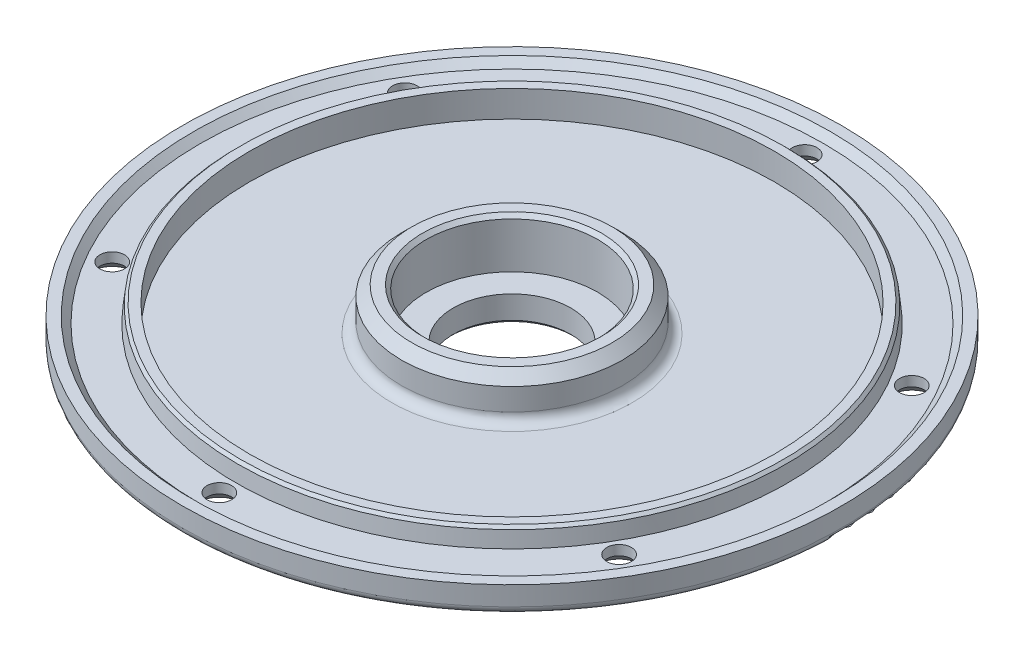
ISO-10303-21;
HEADER;
FILE_DESCRIPTION(('STEP AP214'),'2;1');
FILE_NAME('part.step','',(''),(''),'','','');
FILE_SCHEMA(('AUTOMOTIVE_DESIGN { 1 0 10303 214 1 1 1 1 }'));
ENDSEC;
DATA;
#1=APPLICATION_CONTEXT('core data for automotive mechanical design processes');
#2=APPLICATION_PROTOCOL_DEFINITION('international standard','automotive_design',2000,#1);
#3=PRODUCT_CONTEXT('',#1,'mechanical');
#4=PRODUCT('Part','Part','',(#3));
#5=PRODUCT_RELATED_PRODUCT_CATEGORY('part','',(#4));
#6=PRODUCT_DEFINITION_FORMATION('','',#4);
#7=PRODUCT_DEFINITION_CONTEXT('part definition',#1,'design');
#8=PRODUCT_DEFINITION('design','',#6,#7);
#9=PRODUCT_DEFINITION_SHAPE('','',#8);
#10=(LENGTH_UNIT() NAMED_UNIT(*) SI_UNIT(.MILLI.,.METRE.));
#11=(NAMED_UNIT(*) PLANE_ANGLE_UNIT() SI_UNIT($,.RADIAN.));
#12=(NAMED_UNIT(*) SI_UNIT($,.STERADIAN.) SOLID_ANGLE_UNIT());
#13=UNCERTAINTY_MEASURE_WITH_UNIT(LENGTH_MEASURE(1.E-05),#10,'distance_accuracy_value','');
#14=(GEOMETRIC_REPRESENTATION_CONTEXT(3) GLOBAL_UNCERTAINTY_ASSIGNED_CONTEXT((#13)) GLOBAL_UNIT_ASSIGNED_CONTEXT((#10,
#11,#12)) REPRESENTATION_CONTEXT('',''));
#15=CARTESIAN_POINT('',(0.,0.,0.));
#16=DIRECTION('',(0.,0.,1.));
#17=DIRECTION('',(1.,0.,0.));
#18=AXIS2_PLACEMENT_3D('',#15,#16,#17);
#19=CARTESIAN_POINT('',(0.,0.,0.));
#20=DIRECTION('',(0.,-1.,0.));
#21=DIRECTION('',(0.,0.,-1.));
#22=AXIS2_PLACEMENT_3D('',#19,#20,#21);
#23=CYLINDRICAL_SURFACE('',#22,11.95);
#24=CARTESIAN_POINT('',(0.,56.6,0.));
#25=DIRECTION('',(0.,-1.,0.));
#26=DIRECTION('',(0.,0.,-1.));
#27=AXIS2_PLACEMENT_3D('',#24,#25,#26);
#28=CIRCLE('',#27,11.95);
#29=CARTESIAN_POINT('',(0.,56.6,-11.95));
#30=VERTEX_POINT('',#29);
#31=EDGE_CURVE('E84',#30,#30,#28,.T.);
#32=ORIENTED_EDGE('',*,*,#31,.F.);
#33=EDGE_LOOP('',(#32));
#34=FACE_BOUND('',#33,.T.);
#35=CARTESIAN_POINT('',(0.,51.95,0.));
#36=DIRECTION('',(0.,-1.,0.));
#37=DIRECTION('',(0.,0.,-1.));
#38=AXIS2_PLACEMENT_3D('',#35,#36,#37);
#39=CIRCLE('',#38,11.95);
#40=CARTESIAN_POINT('',(0.,51.95,-11.95));
#41=VERTEX_POINT('',#40);
#42=EDGE_CURVE('E147',#41,#41,#39,.T.);
#43=ORIENTED_EDGE('',*,*,#42,.T.);
#44=EDGE_LOOP('',(#43));
#45=FACE_BOUND('',#44,.T.);
#46=ADVANCED_FACE('F39',(#34,#45),#23,.F.);
#47=CARTESIAN_POINT('',(-11.95,56.6,0.));
#48=DIRECTION('',(0.,-1.,0.));
#49=DIRECTION('',(0.,0.,-1.));
#50=AXIS2_PLACEMENT_3D('',#47,#48,#49);
#51=PLANE('',#50);
#52=CARTESIAN_POINT('',(0.,56.6,0.));
#53=DIRECTION('',(0.,-1.,0.));
#54=DIRECTION('',(0.,0.,-1.));
#55=AXIS2_PLACEMENT_3D('',#52,#53,#54);
#56=CIRCLE('',#55,17.45);
#57=CARTESIAN_POINT('',(0.,56.6,-17.45));
#58=VERTEX_POINT('',#57);
#59=EDGE_CURVE('E87',#58,#58,#56,.T.);
#60=ORIENTED_EDGE('',*,*,#59,.F.);
#61=EDGE_LOOP('',(#60));
#62=FACE_BOUND('',#61,.T.);
#63=ORIENTED_EDGE('',*,*,#31,.T.);
#64=EDGE_LOOP('',(#63));
#65=FACE_BOUND('',#64,.T.);
#66=ADVANCED_FACE('F192',(#62,#65),#51,.F.);
#67=CARTESIAN_POINT('',(0.,0.,0.));
#68=DIRECTION('',(0.,-1.,0.));
#69=DIRECTION('',(0.,0.,-1.));
#70=AXIS2_PLACEMENT_3D('',#67,#68,#69);
#71=CYLINDRICAL_SURFACE('',#70,17.45);
#72=CARTESIAN_POINT('',(0.,65.9,0.));
#73=DIRECTION('',(0.,-1.,0.));
#74=DIRECTION('',(0.,0.,-1.));
#75=AXIS2_PLACEMENT_3D('',#72,#73,#74);
#76=CIRCLE('',#75,17.45);
#77=CARTESIAN_POINT('',(0.,65.9,-17.45));
#78=VERTEX_POINT('',#77);
#79=EDGE_CURVE('E90',#78,#78,#76,.T.);
#80=ORIENTED_EDGE('',*,*,#79,.F.);
#81=EDGE_LOOP('',(#80));
#82=FACE_BOUND('',#81,.T.);
#83=ORIENTED_EDGE('',*,*,#59,.T.);
#84=EDGE_LOOP('',(#83));
#85=FACE_BOUND('',#84,.T.);
#86=ADVANCED_FACE('F198',(#82,#85),#71,.F.);
#87=CARTESIAN_POINT('',(0.,65.9,0.));
#88=DIRECTION('',(0.,1.,0.));
#89=DIRECTION('',(0.,0.,1.));
#90=AXIS2_PLACEMENT_3D('',#87,#88,#89);
#91=CONICAL_SURFACE('',#90,17.45,0.785398163397448);
#92=CARTESIAN_POINT('',(0.,66.65,0.));
#93=DIRECTION('',(0.,-1.,0.));
#94=DIRECTION('',(0.,0.,-1.));
#95=AXIS2_PLACEMENT_3D('',#92,#93,#94);
#96=CIRCLE('',#95,18.2);
#97=CARTESIAN_POINT('',(0.,66.65,-18.2));
#98=VERTEX_POINT('',#97);
#99=EDGE_CURVE('E93',#98,#98,#96,.T.);
#100=ORIENTED_EDGE('',*,*,#99,.F.);
#101=EDGE_LOOP('',(#100));
#102=FACE_BOUND('',#101,.T.);
#103=ORIENTED_EDGE('',*,*,#79,.T.);
#104=EDGE_LOOP('',(#103));
#105=FACE_BOUND('',#104,.T.);
#106=ADVANCED_FACE('F484',(#102,#105),#91,.F.);
#107=CARTESIAN_POINT('',(-18.2,66.65,0.));
#108=DIRECTION('',(0.,-1.,0.));
#109=DIRECTION('',(0.,0.,-1.));
#110=AXIS2_PLACEMENT_3D('',#107,#108,#109);
#111=PLANE('',#110);
#112=CARTESIAN_POINT('',(0.,66.65,0.));
#113=DIRECTION('',(0.,-1.,0.));
#114=DIRECTION('',(0.,0.,-1.));
#115=AXIS2_PLACEMENT_3D('',#112,#113,#114);
#116=CIRCLE('',#115,20.4);
#117=CARTESIAN_POINT('',(0.,66.65,-20.4));
#118=VERTEX_POINT('',#117);
#119=EDGE_CURVE('E96',#118,#118,#116,.T.);
#120=ORIENTED_EDGE('',*,*,#119,.F.);
#121=EDGE_LOOP('',(#120));
#122=FACE_BOUND('',#121,.T.);
#123=ORIENTED_EDGE('',*,*,#99,.T.);
#124=EDGE_LOOP('',(#123));
#125=FACE_BOUND('',#124,.T.);
#126=ADVANCED_FACE('F475',(#122,#125),#111,.F.);
#127=CARTESIAN_POINT('',(0.,66.65,0.));
#128=DIRECTION('',(0.,-1.,0.));
#129=DIRECTION('',(0.,0.,-1.));
#130=AXIS2_PLACEMENT_3D('',#127,#128,#129);
#131=CONICAL_SURFACE('',#130,20.4,0.785398163397447);
#132=CARTESIAN_POINT('',(0.,64.6,0.));
#133=DIRECTION('',(0.,-1.,0.));
#134=DIRECTION('',(0.,0.,-1.));
#135=AXIS2_PLACEMENT_3D('',#132,#133,#134);
#136=CIRCLE('',#135,22.45);
#137=CARTESIAN_POINT('',(0.,64.6,-22.45));
#138=VERTEX_POINT('',#137);
#139=EDGE_CURVE('E99',#138,#138,#136,.T.);
#140=ORIENTED_EDGE('',*,*,#139,.F.);
#141=EDGE_LOOP('',(#140));
#142=FACE_BOUND('',#141,.T.);
#143=ORIENTED_EDGE('',*,*,#119,.T.);
#144=EDGE_LOOP('',(#143));
#145=FACE_BOUND('',#144,.T.);
#146=ADVANCED_FACE('F466',(#142,#145),#131,.T.);
#147=CARTESIAN_POINT('',(0.,0.,0.));
#148=DIRECTION('',(0.,-1.,0.));
#149=DIRECTION('',(0.,0.,-1.));
#150=AXIS2_PLACEMENT_3D('',#147,#148,#149);
#151=CYLINDRICAL_SURFACE('',#150,22.45);
#152=CARTESIAN_POINT('',(0.,60.1,0.));
#153=DIRECTION('',(0.,-1.,0.));
#154=DIRECTION('',(0.,0.,-1.));
#155=AXIS2_PLACEMENT_3D('',#152,#153,#154);
#156=CIRCLE('',#155,22.45);
#157=CARTESIAN_POINT('',(0.,60.1,-22.45));
#158=VERTEX_POINT('',#157);
#159=EDGE_CURVE('E102',#158,#158,#156,.T.);
#160=ORIENTED_EDGE('',*,*,#159,.F.);
#161=EDGE_LOOP('',(#160));
#162=FACE_BOUND('',#161,.T.);
#163=ORIENTED_EDGE('',*,*,#139,.T.);
#164=EDGE_LOOP('',(#163));
#165=FACE_BOUND('',#164,.T.);
#166=ADVANCED_FACE('F457',(#162,#165),#151,.T.);
#167=CARTESIAN_POINT('',(0.,60.1,0.));
#168=DIRECTION('',(0.,-1.,0.));
#169=DIRECTION('',(0.,0.,-1.));
#170=AXIS2_PLACEMENT_3D('',#167,#168,#169);
#171=TOROIDAL_SURFACE('',#170,24.45,2.);
#172=CARTESIAN_POINT('',(0.,58.1,0.));
#173=DIRECTION('',(0.,-1.,0.));
#174=DIRECTION('',(0.,0.,-1.));
#175=AXIS2_PLACEMENT_3D('',#172,#173,#174);
#176=CIRCLE('',#175,24.45);
#177=CARTESIAN_POINT('',(0.,58.1,-24.45));
#178=VERTEX_POINT('',#177);
#179=EDGE_CURVE('E105',#178,#178,#176,.T.);
#180=ORIENTED_EDGE('',*,*,#179,.F.);
#181=EDGE_LOOP('',(#180));
#182=FACE_BOUND('',#181,.T.);
#183=ORIENTED_EDGE('',*,*,#159,.T.);
#184=EDGE_LOOP('',(#183));
#185=FACE_BOUND('',#184,.T.);
#186=ADVANCED_FACE('F448',(#182,#185),#171,.F.);
#187=CARTESIAN_POINT('',(-53.35,58.1,0.));
#188=DIRECTION('',(0.,-1.,0.));
#189=DIRECTION('',(0.,0.,-1.));
#190=AXIS2_PLACEMENT_3D('',#187,#188,#189);
#191=PLANE('',#190);
#192=CARTESIAN_POINT('',(0.,58.1,0.));
#193=DIRECTION('',(0.,-1.,0.));
#194=DIRECTION('',(0.,0.,-1.));
#195=AXIS2_PLACEMENT_3D('',#192,#193,#194);
#196=CIRCLE('',#195,53.35);
#197=CARTESIAN_POINT('',(0.,58.1,-53.35));
#198=VERTEX_POINT('',#197);
#199=EDGE_CURVE('E108',#198,#198,#196,.T.);
#200=ORIENTED_EDGE('',*,*,#199,.F.);
#201=EDGE_LOOP('',(#200));
#202=FACE_BOUND('',#201,.T.);
#203=ORIENTED_EDGE('',*,*,#179,.T.);
#204=EDGE_LOOP('',(#203));
#205=FACE_BOUND('',#204,.T.);
#206=ADVANCED_FACE('F439',(#202,#205),#191,.F.);
#207=CARTESIAN_POINT('',(0.,0.,0.));
#208=DIRECTION('',(0.,-1.,0.));
#209=DIRECTION('',(0.,0.,-1.));
#210=AXIS2_PLACEMENT_3D('',#207,#208,#209);
#211=CYLINDRICAL_SURFACE('',#210,53.35);
#212=CARTESIAN_POINT('',(0.,63.5,0.));
#213=DIRECTION('',(0.,-1.,0.));
#214=DIRECTION('',(0.,0.,-1.));
#215=AXIS2_PLACEMENT_3D('',#212,#213,#214);
#216=CIRCLE('',#215,53.35);
#217=CARTESIAN_POINT('',(0.,63.5,-53.35));
#218=VERTEX_POINT('',#217);
#219=EDGE_CURVE('E111',#218,#218,#216,.T.);
#220=ORIENTED_EDGE('',*,*,#219,.F.);
#221=EDGE_LOOP('',(#220));
#222=FACE_BOUND('',#221,.T.);
#223=ORIENTED_EDGE('',*,*,#199,.T.);
#224=EDGE_LOOP('',(#223));
#225=FACE_BOUND('',#224,.T.);
#226=ADVANCED_FACE('F430',(#222,#225),#211,.F.);
#227=CARTESIAN_POINT('',(-55.2,63.5,0.));
#228=DIRECTION('',(0.,-1.,0.));
#229=DIRECTION('',(0.,0.,-1.));
#230=AXIS2_PLACEMENT_3D('',#227,#228,#229);
#231=PLANE('',#230);
#232=CARTESIAN_POINT('',(0.,63.5,0.));
#233=DIRECTION('',(0.,-1.,0.));
#234=DIRECTION('',(0.,0.,-1.));
#235=AXIS2_PLACEMENT_3D('',#232,#233,#234);
#236=CIRCLE('',#235,55.2);
#237=CARTESIAN_POINT('',(0.,63.5,-55.2));
#238=VERTEX_POINT('',#237);
#239=EDGE_CURVE('E114',#238,#238,#236,.T.);
#240=ORIENTED_EDGE('',*,*,#239,.F.);
#241=EDGE_LOOP('',(#240));
#242=FACE_BOUND('',#241,.T.);
#243=ORIENTED_EDGE('',*,*,#219,.T.);
#244=EDGE_LOOP('',(#243));
#245=FACE_BOUND('',#244,.T.);
#246=ADVANCED_FACE('F421',(#242,#245),#231,.F.);
#247=CARTESIAN_POINT('',(0.,63.5,0.));
#248=DIRECTION('',(0.,-1.,0.));
#249=DIRECTION('',(0.,0.,-1.));
#250=AXIS2_PLACEMENT_3D('',#247,#248,#249);
#251=CONICAL_SURFACE('',#250,55.2,0.785398163397448);
#252=CARTESIAN_POINT('',(0.,62.95,0.));
#253=DIRECTION('',(0.,-1.,0.));
#254=DIRECTION('',(0.,0.,-1.));
#255=AXIS2_PLACEMENT_3D('',#252,#253,#254);
#256=CIRCLE('',#255,55.75);
#257=CARTESIAN_POINT('',(0.,62.95,-55.75));
#258=VERTEX_POINT('',#257);
#259=EDGE_CURVE('E117',#258,#258,#256,.T.);
#260=ORIENTED_EDGE('',*,*,#259,.F.);
#261=EDGE_LOOP('',(#260));
#262=FACE_BOUND('',#261,.T.);
#263=ORIENTED_EDGE('',*,*,#239,.T.);
#264=EDGE_LOOP('',(#263));
#265=FACE_BOUND('',#264,.T.);
#266=ADVANCED_FACE('F412',(#262,#265),#251,.T.);
#267=CARTESIAN_POINT('',(0.,62.95,0.));
#268=DIRECTION('',(0.,-1.,0.));
#269=DIRECTION('',(0.,0.,-1.));
#270=AXIS2_PLACEMENT_3D('',#267,#268,#269);
#271=CONICAL_SURFACE('',#270,55.75,0.110657221173897);
#272=CARTESIAN_POINT('',(0.,59.8,0.));
#273=DIRECTION('',(0.,-1.,0.));
#274=DIRECTION('',(0.,0.,-1.));
#275=AXIS2_PLACEMENT_3D('',#272,#273,#274);
#276=CIRCLE('',#275,56.1);
#277=CARTESIAN_POINT('',(0.,59.8,-56.1));
#278=VERTEX_POINT('',#277);
#279=EDGE_CURVE('E120',#278,#278,#276,.T.);
#280=ORIENTED_EDGE('',*,*,#279,.F.);
#281=EDGE_LOOP('',(#280));
#282=FACE_BOUND('',#281,.T.);
#283=ORIENTED_EDGE('',*,*,#259,.T.);
#284=EDGE_LOOP('',(#283));
#285=FACE_BOUND('',#284,.T.);
#286=ADVANCED_FACE('F252',(#282,#285),#271,.T.);
#287=CARTESIAN_POINT('',(-63.4,59.8,0.));
#288=DIRECTION('',(0.,-1.,0.));
#289=DIRECTION('',(0.,0.,-1.));
#290=AXIS2_PLACEMENT_3D('',#287,#288,#289);
#291=PLANE('',#290);
#292=CARTESIAN_POINT('',(51.5285115251737,59.8,29.7500000000006));
#293=DIRECTION('',(0.,-1.,0.));
#294=DIRECTION('',(0.,0.,-1.));
#295=AXIS2_PLACEMENT_3D('',#292,#293,#294);
#296=CIRCLE('',#295,2.5);
#297=CARTESIAN_POINT('',(51.5285115251737,59.8,27.2500000000006));
#298=VERTEX_POINT('',#297);
#299=EDGE_CURVE('E153',#298,#298,#296,.T.);
#300=ORIENTED_EDGE('',*,*,#299,.T.);
#301=EDGE_LOOP('',(#300));
#302=FACE_BOUND('',#301,.T.);
#303=CARTESIAN_POINT('',(51.5285115251744,59.8,-29.7499999999995));
#304=DIRECTION('',(0.,-1.,0.));
#305=DIRECTION('',(0.,0.,-1.));
#306=AXIS2_PLACEMENT_3D('',#303,#304,#305);
#307=CIRCLE('',#306,2.5);
#308=CARTESIAN_POINT('',(51.5285115251744,59.8,-32.2499999999995));
#309=VERTEX_POINT('',#308);
#310=EDGE_CURVE('E156',#309,#309,#307,.T.);
#311=ORIENTED_EDGE('',*,*,#310,.T.);
#312=EDGE_LOOP('',(#311));
#313=FACE_BOUND('',#312,.T.);
#314=CARTESIAN_POINT('',(0.,59.8,-59.5));
#315=DIRECTION('',(0.,-1.,0.));
#316=DIRECTION('',(0.,0.,-1.));
#317=AXIS2_PLACEMENT_3D('',#314,#315,#316);
#318=CIRCLE('',#317,2.5);
#319=CARTESIAN_POINT('',(0.,59.8,-62.));
#320=VERTEX_POINT('',#319);
#321=EDGE_CURVE('E159',#320,#320,#318,.T.);
#322=ORIENTED_EDGE('',*,*,#321,.T.);
#323=EDGE_LOOP('',(#322));
#324=FACE_BOUND('',#323,.T.);
#325=CARTESIAN_POINT('',(-51.528511525174,59.8,-29.7500000000002));
#326=DIRECTION('',(0.,-1.,0.));
#327=DIRECTION('',(0.,0.,-1.));
#328=AXIS2_PLACEMENT_3D('',#325,#326,#327);
#329=CIRCLE('',#328,2.5);
#330=CARTESIAN_POINT('',(-51.528511525174,59.8,-32.2500000000002));
#331=VERTEX_POINT('',#330);
#332=EDGE_CURVE('E162',#331,#331,#329,.T.);
#333=ORIENTED_EDGE('',*,*,#332,.T.);
#334=EDGE_LOOP('',(#333));
#335=FACE_BOUND('',#334,.T.);
#336=CARTESIAN_POINT('',(-51.5285115251742,59.8,29.7499999999999));
#337=DIRECTION('',(0.,-1.,0.));
#338=DIRECTION('',(0.,0.,-1.));
#339=AXIS2_PLACEMENT_3D('',#336,#337,#338);
#340=CIRCLE('',#339,2.5);
#341=CARTESIAN_POINT('',(-51.5285115251742,59.8,27.2499999999999));
#342=VERTEX_POINT('',#341);
#343=EDGE_CURVE('E165',#342,#342,#340,.T.);
#344=ORIENTED_EDGE('',*,*,#343,.T.);
#345=EDGE_LOOP('',(#344));
#346=FACE_BOUND('',#345,.T.);
#347=CARTESIAN_POINT('',(0.,59.8,59.5));
#348=DIRECTION('',(0.,-1.,0.));
#349=DIRECTION('',(0.,0.,-1.));
#350=AXIS2_PLACEMENT_3D('',#347,#348,#349);
#351=CIRCLE('',#350,2.5);
#352=CARTESIAN_POINT('',(0.,59.8,57.));
#353=VERTEX_POINT('',#352);
#354=EDGE_CURVE('E150',#353,#353,#351,.T.);
#355=ORIENTED_EDGE('',*,*,#354,.T.);
#356=EDGE_LOOP('',(#355));
#357=FACE_BOUND('',#356,.T.);
#358=CARTESIAN_POINT('',(0.,59.8,0.));
#359=DIRECTION('',(0.,-1.,0.));
#360=DIRECTION('',(0.,0.,-1.));
#361=AXIS2_PLACEMENT_3D('',#358,#359,#360);
#362=CIRCLE('',#361,63.4);
#363=CARTESIAN_POINT('',(0.,59.8,-63.4));
#364=VERTEX_POINT('',#363);
#365=EDGE_CURVE('E123',#364,#364,#362,.T.);
#366=ORIENTED_EDGE('',*,*,#365,.F.);
#367=EDGE_LOOP('',(#366));
#368=FACE_BOUND('',#367,.T.);
#369=ORIENTED_EDGE('',*,*,#279,.T.);
#370=EDGE_LOOP('',(#369));
#371=FACE_BOUND('',#370,.T.);
#372=ADVANCED_FACE('F169',(#302,#313,#324,#335,#346,#357,#368,#371),#291,.F.);
#373=CARTESIAN_POINT('',(0.,59.8,0.));
#374=DIRECTION('',(0.,1.,0.));
#375=DIRECTION('',(0.,0.,1.));
#376=AXIS2_PLACEMENT_3D('',#373,#374,#375);
#377=CONICAL_SURFACE('',#376,63.4,0.785398163397448);
#378=CARTESIAN_POINT('',(0.,61.2,0.));
#379=DIRECTION('',(0.,-1.,0.));
#380=DIRECTION('',(0.,0.,-1.));
#381=AXIS2_PLACEMENT_3D('',#378,#379,#380);
#382=CIRCLE('',#381,64.8);
#383=CARTESIAN_POINT('',(0.,61.2,-64.8));
#384=VERTEX_POINT('',#383);
#385=EDGE_CURVE('E126',#384,#384,#382,.T.);
#386=ORIENTED_EDGE('',*,*,#385,.F.);
#387=EDGE_LOOP('',(#386));
#388=FACE_BOUND('',#387,.T.);
#389=ORIENTED_EDGE('',*,*,#365,.T.);
#390=EDGE_LOOP('',(#389));
#391=FACE_BOUND('',#390,.T.);
#392=ADVANCED_FACE('F251',(#388,#391),#377,.F.);
#393=CARTESIAN_POINT('',(-67.,61.2,0.));
#394=DIRECTION('',(0.,-1.,0.));
#395=DIRECTION('',(0.,0.,-1.));
#396=AXIS2_PLACEMENT_3D('',#393,#394,#395);
#397=PLANE('',#396);
#398=CARTESIAN_POINT('',(0.,61.2,0.));
#399=DIRECTION('',(0.,-1.,0.));
#400=DIRECTION('',(0.,0.,-1.));
#401=AXIS2_PLACEMENT_3D('',#398,#399,#400);
#402=CIRCLE('',#401,67.);
#403=CARTESIAN_POINT('',(0.,61.2,-67.));
#404=VERTEX_POINT('',#403);
#405=EDGE_CURVE('E129',#404,#404,#402,.T.);
#406=ORIENTED_EDGE('',*,*,#405,.F.);
#407=EDGE_LOOP('',(#406));
#408=FACE_BOUND('',#407,.T.);
#409=ORIENTED_EDGE('',*,*,#385,.T.);
#410=EDGE_LOOP('',(#409));
#411=FACE_BOUND('',#410,.T.);
#412=ADVANCED_FACE('F382',(#408,#411),#397,.F.);
#413=CARTESIAN_POINT('',(0.,0.,0.));
#414=DIRECTION('',(0.,-1.,0.));
#415=DIRECTION('',(0.,0.,-1.));
#416=AXIS2_PLACEMENT_3D('',#413,#414,#415);
#417=CYLINDRICAL_SURFACE('',#416,67.);
#418=CARTESIAN_POINT('',(0.,57.3,0.));
#419=DIRECTION('',(0.,-1.,0.));
#420=DIRECTION('',(0.,0.,-1.));
#421=AXIS2_PLACEMENT_3D('',#418,#419,#420);
#422=CIRCLE('',#421,67.);
#423=CARTESIAN_POINT('',(0.,57.3,-67.));
#424=VERTEX_POINT('',#423);
#425=EDGE_CURVE('E132',#424,#424,#422,.T.);
#426=ORIENTED_EDGE('',*,*,#425,.F.);
#427=EDGE_LOOP('',(#426));
#428=FACE_BOUND('',#427,.T.);
#429=ORIENTED_EDGE('',*,*,#405,.T.);
#430=EDGE_LOOP('',(#429));
#431=FACE_BOUND('',#430,.T.);
#432=ADVANCED_FACE('F373',(#428,#431),#417,.T.);
#433=CARTESIAN_POINT('',(0.,57.3,0.));
#434=DIRECTION('',(0.,-1.,0.));
#435=DIRECTION('',(0.,0.,-1.));
#436=AXIS2_PLACEMENT_3D('',#433,#434,#435);
#437=TOROIDAL_SURFACE('',#436,65.5,1.5);
#438=CARTESIAN_POINT('',(0.,55.8,0.));
#439=DIRECTION('',(0.,-1.,0.));
#440=DIRECTION('',(0.,0.,-1.));
#441=AXIS2_PLACEMENT_3D('',#438,#439,#440);
#442=CIRCLE('',#441,65.5);
#443=CARTESIAN_POINT('',(0.,55.8,-65.5));
#444=VERTEX_POINT('',#443);
#445=EDGE_CURVE('E135',#444,#444,#442,.T.);
#446=ORIENTED_EDGE('',*,*,#445,.F.);
#447=EDGE_LOOP('',(#446));
#448=FACE_BOUND('',#447,.T.);
#449=ORIENTED_EDGE('',*,*,#425,.T.);
#450=EDGE_LOOP('',(#449));
#451=FACE_BOUND('',#450,.T.);
#452=ADVANCED_FACE('F365',(#448,#451),#437,.T.);
#453=CARTESIAN_POINT('',(-21.9,55.8,0.));
#454=DIRECTION('',(0.,1.,0.));
#455=DIRECTION('',(0.,0.,1.));
#456=AXIS2_PLACEMENT_3D('',#453,#454,#455);
#457=PLANE('',#456);
#458=CARTESIAN_POINT('',(51.5285115251737,55.8,29.7500000000006));
#459=DIRECTION('',(0.,1.,0.));
#460=DIRECTION('',(0.,0.,1.));
#461=AXIS2_PLACEMENT_3D('',#458,#459,#460);
#462=CIRCLE('',#461,4.50000000000003);
#463=CARTESIAN_POINT('',(51.5285115251737,55.8,34.2500000000006));
#464=VERTEX_POINT('',#463);
#465=EDGE_CURVE('E10',#464,#464,#462,.T.);
#466=ORIENTED_EDGE('',*,*,#465,.T.);
#467=EDGE_LOOP('',(#466));
#468=FACE_BOUND('',#467,.T.);
#469=CARTESIAN_POINT('',(51.5285115251744,55.8,-29.7499999999995));
#470=DIRECTION('',(0.,1.,0.));
#471=DIRECTION('',(0.,0.,1.));
#472=AXIS2_PLACEMENT_3D('',#469,#470,#471);
#473=CIRCLE('',#472,4.49999999999995);
#474=CARTESIAN_POINT('',(51.5285115251744,55.8,-25.2499999999996));
#475=VERTEX_POINT('',#474);
#476=EDGE_CURVE('E51',#475,#475,#473,.T.);
#477=ORIENTED_EDGE('',*,*,#476,.T.);
#478=EDGE_LOOP('',(#477));
#479=FACE_BOUND('',#478,.T.);
#480=CARTESIAN_POINT('',(0.,55.8,-59.5));
#481=DIRECTION('',(0.,1.,0.));
#482=DIRECTION('',(0.,0.,1.));
#483=AXIS2_PLACEMENT_3D('',#480,#481,#482);
#484=CIRCLE('',#483,4.49999999999998);
#485=CARTESIAN_POINT('',(0.,55.8,-55.));
#486=VERTEX_POINT('',#485);
#487=EDGE_CURVE('E60',#486,#486,#484,.T.);
#488=ORIENTED_EDGE('',*,*,#487,.T.);
#489=EDGE_LOOP('',(#488));
#490=FACE_BOUND('',#489,.T.);
#491=CARTESIAN_POINT('',(-51.528511525174,55.8,-29.7500000000002));
#492=DIRECTION('',(0.,1.,0.));
#493=DIRECTION('',(0.,0.,1.));
#494=AXIS2_PLACEMENT_3D('',#491,#492,#493);
#495=CIRCLE('',#494,4.50000000000007);
#496=CARTESIAN_POINT('',(-51.528511525174,55.8,-25.2500000000002));
#497=VERTEX_POINT('',#496);
#498=EDGE_CURVE('E66',#497,#497,#495,.T.);
#499=ORIENTED_EDGE('',*,*,#498,.T.);
#500=EDGE_LOOP('',(#499));
#501=FACE_BOUND('',#500,.T.);
#502=CARTESIAN_POINT('',(-51.5285115251742,55.8,29.7499999999999));
#503=DIRECTION('',(0.,1.,0.));
#504=DIRECTION('',(0.,0.,1.));
#505=AXIS2_PLACEMENT_3D('',#502,#503,#504);
#506=CIRCLE('',#505,4.50000000000002);
#507=CARTESIAN_POINT('',(-51.5285115251742,55.8,34.2499999999999));
#508=VERTEX_POINT('',#507);
#509=EDGE_CURVE('E72',#508,#508,#506,.T.);
#510=ORIENTED_EDGE('',*,*,#509,.T.);
#511=EDGE_LOOP('',(#510));
#512=FACE_BOUND('',#511,.T.);
#513=CARTESIAN_POINT('',(0.,55.8,59.5));
#514=DIRECTION('',(0.,1.,0.));
#515=DIRECTION('',(0.,0.,1.));
#516=AXIS2_PLACEMENT_3D('',#513,#514,#515);
#517=CIRCLE('',#516,4.49999999999998);
#518=CARTESIAN_POINT('',(0.,55.8,64.));
#519=VERTEX_POINT('',#518);
#520=EDGE_CURVE('E78',#519,#519,#517,.T.);
#521=ORIENTED_EDGE('',*,*,#520,.T.);
#522=EDGE_LOOP('',(#521));
#523=FACE_BOUND('',#522,.T.);
#524=CARTESIAN_POINT('',(0.,55.8,0.));
#525=DIRECTION('',(0.,-1.,0.));
#526=DIRECTION('',(0.,0.,-1.));
#527=AXIS2_PLACEMENT_3D('',#524,#525,#526);
#528=CIRCLE('',#527,21.9);
#529=CARTESIAN_POINT('',(0.,55.8,-21.9));
#530=VERTEX_POINT('',#529);
#531=EDGE_CURVE('E138',#530,#530,#528,.T.);
#532=ORIENTED_EDGE('',*,*,#531,.F.);
#533=EDGE_LOOP('',(#532));
#534=FACE_BOUND('',#533,.T.);
#535=ORIENTED_EDGE('',*,*,#445,.T.);
#536=EDGE_LOOP('',(#535));
#537=FACE_BOUND('',#536,.T.);
#538=ADVANCED_FACE('F357',(#468,#479,#490,#501,#512,#523,#534,#537),#457,.F.);
#539=CARTESIAN_POINT('',(0.,55.8,0.));
#540=DIRECTION('',(0.,1.,0.));
#541=DIRECTION('',(0.,0.,1.));
#542=AXIS2_PLACEMENT_3D('',#539,#540,#541);
#543=CONICAL_SURFACE('',#542,21.9,0.98279372324733);
#544=CARTESIAN_POINT('',(0.,51.2,0.));
#545=DIRECTION('',(0.,-1.,0.));
#546=DIRECTION('',(0.,0.,-1.));
#547=AXIS2_PLACEMENT_3D('',#544,#545,#546);
#548=CIRCLE('',#547,15.);
#549=CARTESIAN_POINT('',(0.,51.2,-15.));
#550=VERTEX_POINT('',#549);
#551=EDGE_CURVE('E141',#550,#550,#548,.T.);
#552=ORIENTED_EDGE('',*,*,#551,.F.);
#553=EDGE_LOOP('',(#552));
#554=FACE_BOUND('',#553,.T.);
#555=ORIENTED_EDGE('',*,*,#531,.T.);
#556=EDGE_LOOP('',(#555));
#557=FACE_BOUND('',#556,.T.);
#558=ADVANCED_FACE('F348',(#554,#557),#543,.T.);
#559=CARTESIAN_POINT('',(-12.7,51.2,0.));
#560=DIRECTION('',(0.,1.,0.));
#561=DIRECTION('',(0.,0.,1.));
#562=AXIS2_PLACEMENT_3D('',#559,#560,#561);
#563=PLANE('',#562);
#564=CARTESIAN_POINT('',(0.,51.2,0.));
#565=DIRECTION('',(0.,-1.,0.));
#566=DIRECTION('',(0.,0.,-1.));
#567=AXIS2_PLACEMENT_3D('',#564,#565,#566);
#568=CIRCLE('',#567,12.7);
#569=CARTESIAN_POINT('',(0.,51.2,-12.7));
#570=VERTEX_POINT('',#569);
#571=EDGE_CURVE('E144',#570,#570,#568,.T.);
#572=ORIENTED_EDGE('',*,*,#571,.F.);
#573=EDGE_LOOP('',(#572));
#574=FACE_BOUND('',#573,.T.);
#575=ORIENTED_EDGE('',*,*,#551,.T.);
#576=EDGE_LOOP('',(#575));
#577=FACE_BOUND('',#576,.T.);
#578=ADVANCED_FACE('F339',(#574,#577),#563,.F.);
#579=CARTESIAN_POINT('',(0.,51.2,0.));
#580=DIRECTION('',(0.,-1.,0.));
#581=DIRECTION('',(0.,0.,-1.));
#582=AXIS2_PLACEMENT_3D('',#579,#580,#581);
#583=CONICAL_SURFACE('',#582,12.7,0.785398163397448);
#584=ORIENTED_EDGE('',*,*,#42,.F.);
#585=EDGE_LOOP('',(#584));
#586=FACE_BOUND('',#585,.T.);
#587=ORIENTED_EDGE('',*,*,#571,.T.);
#588=EDGE_LOOP('',(#587));
#589=FACE_BOUND('',#588,.T.);
#590=ADVANCED_FACE('F331',(#586,#589),#583,.F.);
#591=CARTESIAN_POINT('',(0.,66.65,59.5));
#592=DIRECTION('',(0.,-1.,0.));
#593=DIRECTION('',(0.,0.,-1.));
#594=AXIS2_PLACEMENT_3D('',#591,#592,#593);
#595=CYLINDRICAL_SURFACE('',#594,2.5);
#596=CARTESIAN_POINT('',(0.,57.8,59.5));
#597=DIRECTION('',(0.,1.,0.));
#598=DIRECTION('',(0.,0.,1.));
#599=AXIS2_PLACEMENT_3D('',#596,#597,#598);
#600=CIRCLE('',#599,2.5);
#601=CARTESIAN_POINT('',(0.,57.8,62.));
#602=VERTEX_POINT('',#601);
#603=EDGE_CURVE('E81',#602,#602,#600,.F.);
#604=ORIENTED_EDGE('',*,*,#603,.T.);
#605=EDGE_LOOP('',(#604));
#606=FACE_BOUND('',#605,.T.);
#607=ORIENTED_EDGE('',*,*,#354,.F.);
#608=EDGE_LOOP('',(#607));
#609=FACE_BOUND('',#608,.T.);
#610=ADVANCED_FACE('F186',(#606,#609),#595,.F.);
#611=CARTESIAN_POINT('',(0.,57.8,59.5));
#612=DIRECTION('',(0.,-1.,0.));
#613=DIRECTION('',(0.,0.,-1.));
#614=AXIS2_PLACEMENT_3D('',#611,#612,#613);
#615=CONICAL_SURFACE('',#614,2.5,0.785398163397449);
#616=ORIENTED_EDGE('',*,*,#520,.F.);
#617=EDGE_LOOP('',(#616));
#618=FACE_BOUND('',#617,.T.);
#619=ORIENTED_EDGE('',*,*,#603,.F.);
#620=EDGE_LOOP('',(#619));
#621=FACE_BOUND('',#620,.T.);
#622=ADVANCED_FACE('F175',(#618,#621),#615,.F.);
#623=CARTESIAN_POINT('',(-51.5285115251742,66.65,29.7499999999999));
#624=DIRECTION('',(0.,-1.,0.));
#625=DIRECTION('',(0.,0.,-1.));
#626=AXIS2_PLACEMENT_3D('',#623,#624,#625);
#627=CYLINDRICAL_SURFACE('',#626,2.5);
#628=CARTESIAN_POINT('',(-51.5285115251742,57.8,29.7499999999999));
#629=DIRECTION('',(0.,1.,0.));
#630=DIRECTION('',(0.,0.,1.));
#631=AXIS2_PLACEMENT_3D('',#628,#629,#630);
#632=CIRCLE('',#631,2.5);
#633=CARTESIAN_POINT('',(-51.5285115251742,57.8,32.2499999999999));
#634=VERTEX_POINT('',#633);
#635=EDGE_CURVE('E75',#634,#634,#632,.F.);
#636=ORIENTED_EDGE('',*,*,#635,.T.);
#637=EDGE_LOOP('',(#636));
#638=FACE_BOUND('',#637,.T.);
#639=ORIENTED_EDGE('',*,*,#343,.F.);
#640=EDGE_LOOP('',(#639));
#641=FACE_BOUND('',#640,.T.);
#642=ADVANCED_FACE('F172',(#638,#641),#627,.F.);
#643=CARTESIAN_POINT('',(-51.528511525174,66.65,-29.7500000000002));
#644=DIRECTION('',(0.,-1.,0.));
#645=DIRECTION('',(0.,0.,-1.));
#646=AXIS2_PLACEMENT_3D('',#643,#644,#645);
#647=CYLINDRICAL_SURFACE('',#646,2.5);
#648=CARTESIAN_POINT('',(-51.528511525174,57.8,-29.7500000000002));
#649=DIRECTION('',(0.,1.,0.));
#650=DIRECTION('',(0.,0.,1.));
#651=AXIS2_PLACEMENT_3D('',#648,#649,#650);
#652=CIRCLE('',#651,2.5);
#653=CARTESIAN_POINT('',(-51.528511525174,57.8,-27.2500000000002));
#654=VERTEX_POINT('',#653);
#655=EDGE_CURVE('E69',#654,#654,#652,.F.);
#656=ORIENTED_EDGE('',*,*,#655,.T.);
#657=EDGE_LOOP('',(#656));
#658=FACE_BOUND('',#657,.T.);
#659=ORIENTED_EDGE('',*,*,#332,.F.);
#660=EDGE_LOOP('',(#659));
#661=FACE_BOUND('',#660,.T.);
#662=ADVANCED_FACE('F174',(#658,#661),#647,.F.);
#663=CARTESIAN_POINT('',(0.,66.65,-59.5));
#664=DIRECTION('',(0.,-1.,0.));
#665=DIRECTION('',(0.,0.,-1.));
#666=AXIS2_PLACEMENT_3D('',#663,#664,#665);
#667=CYLINDRICAL_SURFACE('',#666,2.5);
#668=CARTESIAN_POINT('',(0.,57.8,-59.5));
#669=DIRECTION('',(0.,1.,0.));
#670=DIRECTION('',(0.,0.,1.));
#671=AXIS2_PLACEMENT_3D('',#668,#669,#670);
#672=CIRCLE('',#671,2.5);
#673=CARTESIAN_POINT('',(0.,57.8,-57.));
#674=VERTEX_POINT('',#673);
#675=EDGE_CURVE('E63',#674,#674,#672,.F.);
#676=ORIENTED_EDGE('',*,*,#675,.T.);
#677=EDGE_LOOP('',(#676));
#678=FACE_BOUND('',#677,.T.);
#679=ORIENTED_EDGE('',*,*,#321,.F.);
#680=EDGE_LOOP('',(#679));
#681=FACE_BOUND('',#680,.T.);
#682=ADVANCED_FACE('F182',(#678,#681),#667,.F.);
#683=CARTESIAN_POINT('',(51.5285115251744,66.65,-29.7499999999995));
#684=DIRECTION('',(0.,-1.,0.));
#685=DIRECTION('',(0.,0.,-1.));
#686=AXIS2_PLACEMENT_3D('',#683,#684,#685);
#687=CYLINDRICAL_SURFACE('',#686,2.5);
#688=CARTESIAN_POINT('',(51.5285115251744,57.8,-29.7499999999995));
#689=DIRECTION('',(0.,1.,0.));
#690=DIRECTION('',(0.,0.,1.));
#691=AXIS2_PLACEMENT_3D('',#688,#689,#690);
#692=CIRCLE('',#691,2.5);
#693=CARTESIAN_POINT('',(51.5285115251744,57.8,-27.2499999999995));
#694=VERTEX_POINT('',#693);
#695=EDGE_CURVE('E55',#694,#694,#692,.F.);
#696=ORIENTED_EDGE('',*,*,#695,.T.);
#697=EDGE_LOOP('',(#696));
#698=FACE_BOUND('',#697,.T.);
#699=ORIENTED_EDGE('',*,*,#310,.F.);
#700=EDGE_LOOP('',(#699));
#701=FACE_BOUND('',#700,.T.);
#702=ADVANCED_FACE('F243',(#698,#701),#687,.F.);
#703=CARTESIAN_POINT('',(51.5285115251737,66.65,29.7500000000006));
#704=DIRECTION('',(0.,-1.,0.));
#705=DIRECTION('',(0.,0.,-1.));
#706=AXIS2_PLACEMENT_3D('',#703,#704,#705);
#707=CYLINDRICAL_SURFACE('',#706,2.5);
#708=CARTESIAN_POINT('',(51.5285115251737,57.8,29.7500000000006));
#709=DIRECTION('',(0.,1.,0.));
#710=DIRECTION('',(0.,0.,1.));
#711=AXIS2_PLACEMENT_3D('',#708,#709,#710);
#712=CIRCLE('',#711,2.5);
#713=CARTESIAN_POINT('',(51.5285115251737,57.8,32.2500000000006));
#714=VERTEX_POINT('',#713);
#715=EDGE_CURVE('E47',#714,#714,#712,.F.);
#716=ORIENTED_EDGE('',*,*,#715,.T.);
#717=EDGE_LOOP('',(#716));
#718=FACE_BOUND('',#717,.T.);
#719=ORIENTED_EDGE('',*,*,#299,.F.);
#720=EDGE_LOOP('',(#719));
#721=FACE_BOUND('',#720,.T.);
#722=ADVANCED_FACE('F216',(#718,#721),#707,.F.);
#723=CARTESIAN_POINT('',(-51.5285115251742,57.8,29.7499999999999));
#724=DIRECTION('',(0.,-1.,0.));
#725=DIRECTION('',(0.,0.,-1.));
#726=AXIS2_PLACEMENT_3D('',#723,#724,#725);
#727=CONICAL_SURFACE('',#726,2.5,0.785398163397447);
#728=ORIENTED_EDGE('',*,*,#509,.F.);
#729=EDGE_LOOP('',(#728));
#730=FACE_BOUND('',#729,.T.);
#731=ORIENTED_EDGE('',*,*,#635,.F.);
#732=EDGE_LOOP('',(#731));
#733=FACE_BOUND('',#732,.T.);
#734=ADVANCED_FACE('F209',(#730,#733),#727,.F.);
#735=CARTESIAN_POINT('',(-51.528511525174,57.8,-29.7500000000002));
#736=DIRECTION('',(0.,-1.,0.));
#737=DIRECTION('',(0.,0.,-1.));
#738=AXIS2_PLACEMENT_3D('',#735,#736,#737);
#739=CONICAL_SURFACE('',#738,2.5,0.78539816339745);
#740=ORIENTED_EDGE('',*,*,#498,.F.);
#741=EDGE_LOOP('',(#740));
#742=FACE_BOUND('',#741,.T.);
#743=ORIENTED_EDGE('',*,*,#655,.F.);
#744=EDGE_LOOP('',(#743));
#745=FACE_BOUND('',#744,.T.);
#746=ADVANCED_FACE('F215',(#742,#745),#739,.F.);
#747=CARTESIAN_POINT('',(0.,57.8,-59.5));
#748=DIRECTION('',(0.,-1.,0.));
#749=DIRECTION('',(0.,0.,-1.));
#750=AXIS2_PLACEMENT_3D('',#747,#748,#749);
#751=CONICAL_SURFACE('',#750,2.5,0.785398163397449);
#752=ORIENTED_EDGE('',*,*,#487,.F.);
#753=EDGE_LOOP('',(#752));
#754=FACE_BOUND('',#753,.T.);
#755=ORIENTED_EDGE('',*,*,#675,.F.);
#756=EDGE_LOOP('',(#755));
#757=FACE_BOUND('',#756,.T.);
#758=ADVANCED_FACE('F223',(#754,#757),#751,.F.);
#759=CARTESIAN_POINT('',(51.5285115251744,57.8,-29.7499999999995));
#760=DIRECTION('',(0.,-1.,0.));
#761=DIRECTION('',(0.,0.,-1.));
#762=AXIS2_PLACEMENT_3D('',#759,#760,#761);
#763=CONICAL_SURFACE('',#762,2.5,0.785398163397442);
#764=ORIENTED_EDGE('',*,*,#476,.F.);
#765=EDGE_LOOP('',(#764));
#766=FACE_BOUND('',#765,.T.);
#767=ORIENTED_EDGE('',*,*,#695,.F.);
#768=EDGE_LOOP('',(#767));
#769=FACE_BOUND('',#768,.T.);
#770=ADVANCED_FACE('F229',(#766,#769),#763,.F.);
#771=CARTESIAN_POINT('',(51.5285115251737,57.8,29.7500000000006));
#772=DIRECTION('',(0.,-1.,0.));
#773=DIRECTION('',(0.,0.,-1.));
#774=AXIS2_PLACEMENT_3D('',#771,#772,#773);
#775=CONICAL_SURFACE('',#774,2.5,0.785398163397447);
#776=ORIENTED_EDGE('',*,*,#465,.F.);
#777=EDGE_LOOP('',(#776));
#778=FACE_BOUND('',#777,.T.);
#779=ORIENTED_EDGE('',*,*,#715,.F.);
#780=EDGE_LOOP('',(#779));
#781=FACE_BOUND('',#780,.T.);
#782=ADVANCED_FACE('F42',(#778,#781),#775,.F.);
#783=CLOSED_SHELL('',(#46,#66,#86,#106,#126,#146,#166,#186,#206,#226,#246,#266,#286,#372,#392,
#412,#432,#452,#538,#558,#578,#590,#610,#622,#642,#662,#682,#702,#722,#734,#746,#758,#770,#782));
#784=MANIFOLD_SOLID_BREP('B2',#783);
#785=ADVANCED_BREP_SHAPE_REPRESENTATION('',(#18,#784),#14);
#786=SHAPE_DEFINITION_REPRESENTATION(#9,#785);
ENDSEC;
END-ISO-10303-21;
